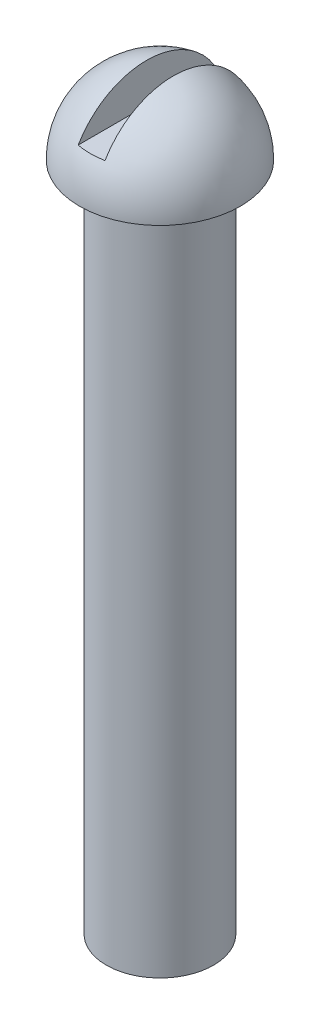
ISO-10303-21;
HEADER;
FILE_DESCRIPTION(('STEP AP214'),'2;1');
FILE_NAME('part.step','',(''),(''),'','','');
FILE_SCHEMA(('AUTOMOTIVE_DESIGN { 1 0 10303 214 1 1 1 1 }'));
ENDSEC;
DATA;
#1=APPLICATION_CONTEXT('core data for automotive mechanical design processes');
#2=APPLICATION_PROTOCOL_DEFINITION('international standard','automotive_design',2000,#1);
#3=PRODUCT_CONTEXT('',#1,'mechanical');
#4=PRODUCT('Part','Part','',(#3));
#5=PRODUCT_RELATED_PRODUCT_CATEGORY('part','',(#4));
#6=PRODUCT_DEFINITION_FORMATION('','',#4);
#7=PRODUCT_DEFINITION_CONTEXT('part definition',#1,'design');
#8=PRODUCT_DEFINITION('design','',#6,#7);
#9=PRODUCT_DEFINITION_SHAPE('','',#8);
#10=(LENGTH_UNIT() NAMED_UNIT(*) SI_UNIT(.MILLI.,.METRE.));
#11=(NAMED_UNIT(*) PLANE_ANGLE_UNIT() SI_UNIT($,.RADIAN.));
#12=(NAMED_UNIT(*) SI_UNIT($,.STERADIAN.) SOLID_ANGLE_UNIT());
#13=UNCERTAINTY_MEASURE_WITH_UNIT(LENGTH_MEASURE(1.E-05),#10,'distance_accuracy_value','');
#14=(GEOMETRIC_REPRESENTATION_CONTEXT(3) GLOBAL_UNCERTAINTY_ASSIGNED_CONTEXT((#13)) GLOBAL_UNIT_ASSIGNED_CONTEXT((#10,
#11,#12)) REPRESENTATION_CONTEXT('',''));
#15=CARTESIAN_POINT('',(0.,0.,0.));
#16=DIRECTION('',(0.,0.,1.));
#17=DIRECTION('',(1.,0.,0.));
#18=AXIS2_PLACEMENT_3D('',#15,#16,#17);
#19=CARTESIAN_POINT('',(0.,3.,0.));
#20=DIRECTION('',(0.,1.,0.));
#21=DIRECTION('',(0.,0.,1.));
#22=AXIS2_PLACEMENT_3D('',#19,#20,#21);
#23=CYLINDRICAL_SURFACE('',#22,2.);
#24=CARTESIAN_POINT('',(0.,-25.,0.));
#25=DIRECTION('',(0.,1.,0.));
#26=DIRECTION('',(0.,0.,1.));
#27=AXIS2_PLACEMENT_3D('',#24,#25,#26);
#28=CIRCLE('',#27,2.);
#29=CARTESIAN_POINT('',(0.,-25.,2.));
#30=VERTEX_POINT('',#29);
#31=EDGE_CURVE('E80',#30,#30,#28,.T.);
#32=ORIENTED_EDGE('',*,*,#31,.T.);
#33=EDGE_LOOP('',(#32));
#34=FACE_BOUND('',#33,.T.);
#35=CARTESIAN_POINT('',(0.,0.,0.));
#36=DIRECTION('',(0.,1.,0.));
#37=DIRECTION('',(0.,0.,1.));
#38=AXIS2_PLACEMENT_3D('',#35,#36,#37);
#39=CIRCLE('',#38,2.);
#40=CARTESIAN_POINT('',(0.,0.,2.));
#41=VERTEX_POINT('',#40);
#42=EDGE_CURVE('E67',#41,#41,#39,.T.);
#43=ORIENTED_EDGE('',*,*,#42,.F.);
#44=EDGE_LOOP('',(#43));
#45=FACE_BOUND('',#44,.T.);
#46=ADVANCED_FACE('F36',(#34,#45),#23,.T.);
#47=CARTESIAN_POINT('',(0.,0.,0.));
#48=DIRECTION('',(0.,1.,0.));
#49=DIRECTION('',(0.,0.,1.));
#50=AXIS2_PLACEMENT_3D('',#47,#48,#49);
#51=PLANE('',#50);
#52=CARTESIAN_POINT('',(0.,0.,0.));
#53=DIRECTION('',(0.,1.,0.));
#54=DIRECTION('',(0.,0.,1.));
#55=AXIS2_PLACEMENT_3D('',#52,#53,#54);
#56=CIRCLE('',#55,3.);
#57=CARTESIAN_POINT('',(0.,0.,3.));
#58=VERTEX_POINT('',#57);
#59=EDGE_CURVE('E77',#58,#58,#56,.T.);
#60=ORIENTED_EDGE('',*,*,#59,.F.);
#61=EDGE_LOOP('',(#60));
#62=FACE_BOUND('',#61,.T.);
#63=ORIENTED_EDGE('',*,*,#42,.T.);
#64=EDGE_LOOP('',(#63));
#65=FACE_BOUND('',#64,.T.);
#66=ADVANCED_FACE('F96',(#62,#65),#51,.F.);
#67=CARTESIAN_POINT('',(0.,0.,0.));
#68=DIRECTION('',(0.,1.,0.));
#69=DIRECTION('',(1.,0.,0.));
#70=AXIS2_PLACEMENT_3D('',#67,#68,#69);
#71=SPHERICAL_SURFACE('',#70,3.);
#72=CARTESIAN_POINT('',(0.,1.5,0.));
#73=DIRECTION('',(0.,-1.,0.));
#74=DIRECTION('',(0.,0.,-1.));
#75=AXIS2_PLACEMENT_3D('',#72,#73,#74);
#76=CIRCLE('',#75,2.59807621135332);
#77=CARTESIAN_POINT('',(-0.5,1.5,-2.54950975679639));
#78=VERTEX_POINT('',#77);
#79=CARTESIAN_POINT('',(0.5,1.5,-2.54950975679639));
#80=VERTEX_POINT('',#79);
#81=EDGE_CURVE('E66',#78,#80,#76,.T.);
#82=ORIENTED_EDGE('',*,*,#81,.T.);
#83=CARTESIAN_POINT('',(0.5,0.,0.));
#84=DIRECTION('',(1.,0.,0.));
#85=DIRECTION('',(0.,0.,-1.));
#86=AXIS2_PLACEMENT_3D('',#83,#84,#85);
#87=CIRCLE('',#86,2.95803989154981);
#88=CARTESIAN_POINT('',(0.5,1.5,2.54950975679639));
#89=VERTEX_POINT('',#88);
#90=EDGE_CURVE('E11',#80,#89,#87,.T.);
#91=ORIENTED_EDGE('',*,*,#90,.T.);
#92=CARTESIAN_POINT('',(-0.5,1.5,2.54950975679639));
#93=VERTEX_POINT('',#92);
#94=EDGE_CURVE('E43',#89,#93,#76,.T.);
#95=ORIENTED_EDGE('',*,*,#94,.T.);
#96=CARTESIAN_POINT('',(-0.5,0.,0.));
#97=DIRECTION('',(1.,0.,0.));
#98=DIRECTION('',(0.,0.,-1.));
#99=AXIS2_PLACEMENT_3D('',#96,#97,#98);
#100=CIRCLE('',#99,2.95803989154981);
#101=EDGE_CURVE('E62',#78,#93,#100,.T.);
#102=ORIENTED_EDGE('',*,*,#101,.F.);
#103=EDGE_LOOP('',(#82,#91,#95,#102));
#104=FACE_BOUND('',#103,.T.);
#105=ORIENTED_EDGE('',*,*,#59,.T.);
#106=EDGE_LOOP('',(#105));
#107=FACE_BOUND('',#106,.T.);
#108=ADVANCED_FACE('F72',(#104,#107),#71,.T.);
#109=CARTESIAN_POINT('',(0.,-25.,0.));
#110=DIRECTION('',(0.,1.,0.));
#111=DIRECTION('',(0.,0.,1.));
#112=AXIS2_PLACEMENT_3D('',#109,#110,#111);
#113=PLANE('',#112);
#114=ORIENTED_EDGE('',*,*,#31,.F.);
#115=EDGE_LOOP('',(#114));
#116=FACE_BOUND('',#115,.T.);
#117=ADVANCED_FACE('F86',(#116),#113,.F.);
#118=CARTESIAN_POINT('',(0.5,0.,-3.));
#119=DIRECTION('',(1.,0.,0.));
#120=DIRECTION('',(0.,0.,-1.));
#121=AXIS2_PLACEMENT_3D('',#118,#119,#120);
#122=PLANE('',#121);
#123=DIRECTION('',(0.,0.,1.));
#124=VECTOR('',#123,1.);
#125=CARTESIAN_POINT('',(0.5,1.5,-3.));
#126=LINE('',#125,#124);
#127=EDGE_CURVE('E70',#80,#89,#126,.T.);
#128=ORIENTED_EDGE('',*,*,#127,.T.);
#129=ORIENTED_EDGE('',*,*,#90,.F.);
#130=EDGE_LOOP('',(#128,#129));
#131=FACE_BOUND('',#130,.T.);
#132=ADVANCED_FACE('F84',(#131),#122,.F.);
#133=CARTESIAN_POINT('',(0.,1.5,-3.));
#134=DIRECTION('',(0.,-1.,0.));
#135=DIRECTION('',(0.,0.,-1.));
#136=AXIS2_PLACEMENT_3D('',#133,#134,#135);
#137=PLANE('',#136);
#138=ORIENTED_EDGE('',*,*,#127,.F.);
#139=ORIENTED_EDGE('',*,*,#81,.F.);
#140=DIRECTION('',(0.,0.,1.));
#141=VECTOR('',#140,1.);
#142=CARTESIAN_POINT('',(-0.5,1.5,-3.));
#143=LINE('',#142,#141);
#144=EDGE_CURVE('E49',#78,#93,#143,.T.);
#145=ORIENTED_EDGE('',*,*,#144,.T.);
#146=ORIENTED_EDGE('',*,*,#94,.F.);
#147=EDGE_LOOP('',(#138,#139,#145,#146));
#148=FACE_BOUND('',#147,.T.);
#149=ADVANCED_FACE('F69',(#148),#137,.F.);
#150=CARTESIAN_POINT('',(-0.5,0.,-3.));
#151=DIRECTION('',(1.,0.,0.));
#152=DIRECTION('',(0.,0.,-1.));
#153=AXIS2_PLACEMENT_3D('',#150,#151,#152);
#154=PLANE('',#153);
#155=ORIENTED_EDGE('',*,*,#101,.T.);
#156=ORIENTED_EDGE('',*,*,#144,.F.);
#157=EDGE_LOOP('',(#155,#156));
#158=FACE_BOUND('',#157,.T.);
#159=ADVANCED_FACE('F63',(#158),#154,.T.);
#160=CLOSED_SHELL('',(#46,#66,#108,#117,#132,#149,#159));
#161=MANIFOLD_SOLID_BREP('B2',#160);
#162=ADVANCED_BREP_SHAPE_REPRESENTATION('',(#18,#161),#14);
#163=SHAPE_DEFINITION_REPRESENTATION(#9,#162);
ENDSEC;
END-ISO-10303-21;
